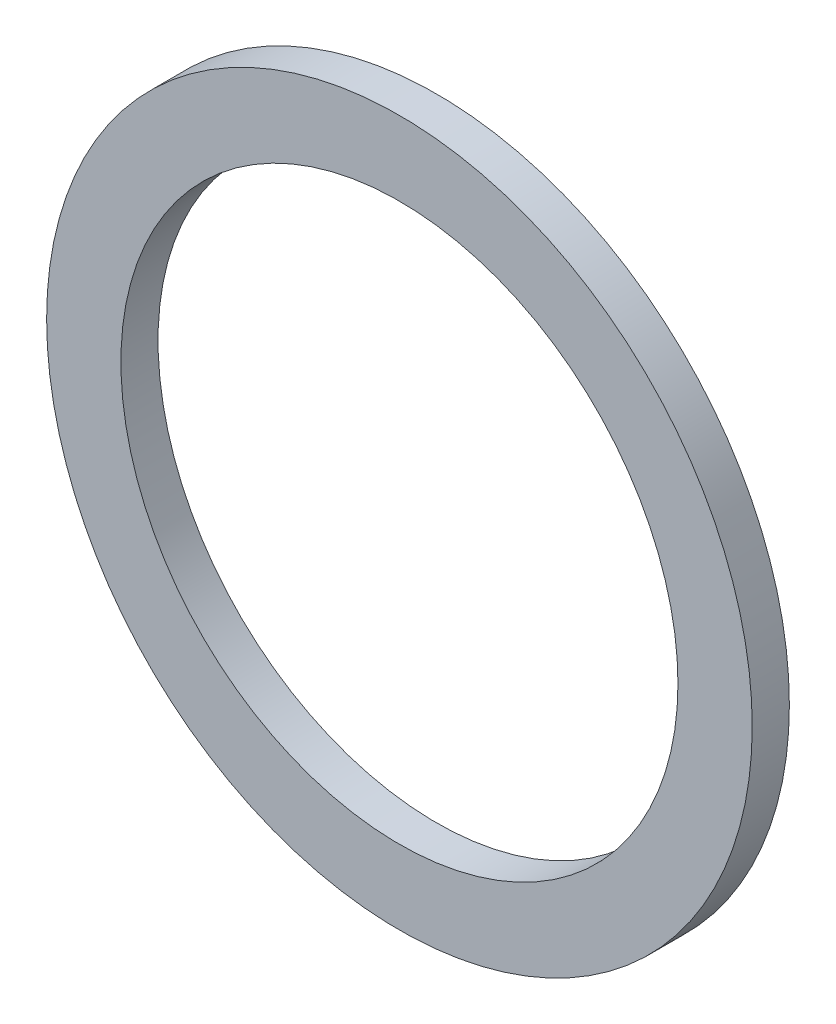
ISO-10303-21;
HEADER;
FILE_DESCRIPTION(('STEP AP214'),'2;1');
FILE_NAME('part.step','',(''),(''),'','','');
FILE_SCHEMA(('AUTOMOTIVE_DESIGN { 1 0 10303 214 1 1 1 1 }'));
ENDSEC;
DATA;
#1=APPLICATION_CONTEXT('core data for automotive mechanical design processes');
#2=APPLICATION_PROTOCOL_DEFINITION('international standard','automotive_design',2000,#1);
#3=PRODUCT_CONTEXT('',#1,'mechanical');
#4=PRODUCT('Part','Part','',(#3));
#5=PRODUCT_RELATED_PRODUCT_CATEGORY('part','',(#4));
#6=PRODUCT_DEFINITION_FORMATION('','',#4);
#7=PRODUCT_DEFINITION_CONTEXT('part definition',#1,'design');
#8=PRODUCT_DEFINITION('design','',#6,#7);
#9=PRODUCT_DEFINITION_SHAPE('','',#8);
#10=(LENGTH_UNIT() NAMED_UNIT(*) SI_UNIT(.MILLI.,.METRE.));
#11=(NAMED_UNIT(*) PLANE_ANGLE_UNIT() SI_UNIT($,.RADIAN.));
#12=(NAMED_UNIT(*) SI_UNIT($,.STERADIAN.) SOLID_ANGLE_UNIT());
#13=UNCERTAINTY_MEASURE_WITH_UNIT(LENGTH_MEASURE(1.E-05),#10,'distance_accuracy_value','');
#14=(GEOMETRIC_REPRESENTATION_CONTEXT(3) GLOBAL_UNCERTAINTY_ASSIGNED_CONTEXT((#13)) GLOBAL_UNIT_ASSIGNED_CONTEXT((#10,
#11,#12)) REPRESENTATION_CONTEXT('',''));
#15=CARTESIAN_POINT('',(0.,0.,0.));
#16=DIRECTION('',(0.,0.,1.));
#17=DIRECTION('',(1.,0.,0.));
#18=AXIS2_PLACEMENT_3D('',#15,#16,#17);
#19=CARTESIAN_POINT('',(0.,0.,0.));
#20=DIRECTION('',(0.,0.,0.999999999999967));
#21=DIRECTION('',(0.999999999999967,0.,0.));
#22=AXIS2_PLACEMENT_3D('',#19,#20,#21);
#23=CYLINDRICAL_SURFACE('',#22,7.5);
#24=CARTESIAN_POINT('',(0.,0.,-1.));
#25=DIRECTION('',(0.,0.,0.999999999999967));
#26=DIRECTION('',(0.999999999999967,0.,0.));
#27=AXIS2_PLACEMENT_3D('',#24,#25,#26);
#28=CIRCLE('',#27,7.5);
#29=CARTESIAN_POINT('',(7.49999999999975,0.,-1.));
#30=VERTEX_POINT('',#29);
#31=EDGE_CURVE('E56',#30,#30,#28,.T.);
#32=ORIENTED_EDGE('',*,*,#31,.F.);
#33=EDGE_LOOP('',(#32));
#34=FACE_BOUND('',#33,.T.);
#35=CARTESIAN_POINT('',(0.,0.,0.));
#36=DIRECTION('',(0.,0.,0.999999999999967));
#37=DIRECTION('',(0.999999999999967,0.,0.));
#38=AXIS2_PLACEMENT_3D('',#35,#36,#37);
#39=CIRCLE('',#38,7.5);
#40=CARTESIAN_POINT('',(7.49999999999975,0.,0.));
#41=VERTEX_POINT('',#40);
#42=EDGE_CURVE('E12',#41,#41,#39,.T.);
#43=ORIENTED_EDGE('',*,*,#42,.T.);
#44=EDGE_LOOP('',(#43));
#45=FACE_BOUND('',#44,.T.);
#46=ADVANCED_FACE('F42',(#34,#45),#23,.F.);
#47=CARTESIAN_POINT('',(-7.50000000000001,0.,0.));
#48=DIRECTION('',(0.,0.,-0.999999999999967));
#49=DIRECTION('',(-0.999999999999967,0.,0.));
#50=AXIS2_PLACEMENT_3D('',#47,#48,#49);
#51=PLANE('',#50);
#52=ORIENTED_EDGE('',*,*,#42,.F.);
#53=EDGE_LOOP('',(#52));
#54=FACE_BOUND('',#53,.T.);
#55=CARTESIAN_POINT('',(0.,0.,0.));
#56=DIRECTION('',(0.,0.,0.999999999999967));
#57=DIRECTION('',(0.999999999999967,0.,0.));
#58=AXIS2_PLACEMENT_3D('',#55,#56,#57);
#59=CIRCLE('',#58,9.5);
#60=CARTESIAN_POINT('',(9.49999999999968,0.,0.));
#61=VERTEX_POINT('',#60);
#62=EDGE_CURVE('E48',#61,#61,#59,.T.);
#63=ORIENTED_EDGE('',*,*,#62,.T.);
#64=EDGE_LOOP('',(#63));
#65=FACE_BOUND('',#64,.T.);
#66=ADVANCED_FACE('F65',(#54,#65),#51,.F.);
#67=CARTESIAN_POINT('',(0.,0.,0.));
#68=DIRECTION('',(0.,0.,0.999999999999967));
#69=DIRECTION('',(0.999999999999967,0.,0.));
#70=AXIS2_PLACEMENT_3D('',#67,#68,#69);
#71=CYLINDRICAL_SURFACE('',#70,9.5);
#72=ORIENTED_EDGE('',*,*,#62,.F.);
#73=EDGE_LOOP('',(#72));
#74=FACE_BOUND('',#73,.T.);
#75=CARTESIAN_POINT('',(0.,0.,-1.));
#76=DIRECTION('',(0.,0.,0.999999999999967));
#77=DIRECTION('',(0.999999999999967,0.,0.));
#78=AXIS2_PLACEMENT_3D('',#75,#76,#77);
#79=CIRCLE('',#78,9.5);
#80=CARTESIAN_POINT('',(9.49999999999968,0.,-1.));
#81=VERTEX_POINT('',#80);
#82=EDGE_CURVE('E52',#81,#81,#79,.T.);
#83=ORIENTED_EDGE('',*,*,#82,.T.);
#84=EDGE_LOOP('',(#83));
#85=FACE_BOUND('',#84,.T.);
#86=ADVANCED_FACE('F69',(#74,#85),#71,.T.);
#87=CARTESIAN_POINT('',(-9.50000000000001,0.,-1.));
#88=DIRECTION('',(0.,0.,0.999999999999967));
#89=DIRECTION('',(0.999999999999967,0.,0.));
#90=AXIS2_PLACEMENT_3D('',#87,#88,#89);
#91=PLANE('',#90);
#92=ORIENTED_EDGE('',*,*,#82,.F.);
#93=EDGE_LOOP('',(#92));
#94=FACE_BOUND('',#93,.T.);
#95=ORIENTED_EDGE('',*,*,#31,.T.);
#96=EDGE_LOOP('',(#95));
#97=FACE_BOUND('',#96,.T.);
#98=ADVANCED_FACE('F62',(#94,#97),#91,.F.);
#99=CLOSED_SHELL('',(#46,#66,#86,#98));
#100=MANIFOLD_SOLID_BREP('B2',#99);
#101=ADVANCED_BREP_SHAPE_REPRESENTATION('',(#18,#100),#14);
#102=SHAPE_DEFINITION_REPRESENTATION(#9,#101);
ENDSEC;
END-ISO-10303-21;
